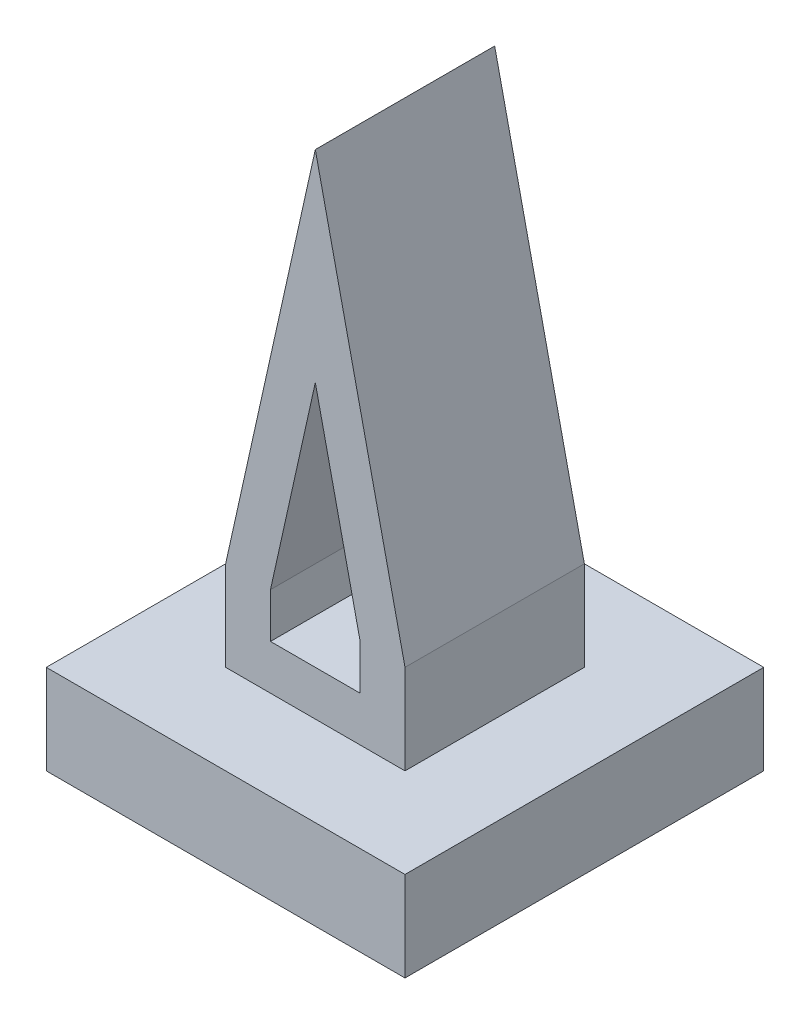
ISO-10303-21;
HEADER;
FILE_DESCRIPTION(('STEP AP214'),'2;1');
FILE_NAME('part.step','',(''),(''),'','','');
FILE_SCHEMA(('AUTOMOTIVE_DESIGN { 1 0 10303 214 1 1 1 1 }'));
ENDSEC;
DATA;
#1=APPLICATION_CONTEXT('core data for automotive mechanical design processes');
#2=APPLICATION_PROTOCOL_DEFINITION('international standard','automotive_design',2000,#1);
#3=PRODUCT_CONTEXT('',#1,'mechanical');
#4=PRODUCT('Part','Part','',(#3));
#5=PRODUCT_RELATED_PRODUCT_CATEGORY('part','',(#4));
#6=PRODUCT_DEFINITION_FORMATION('','',#4);
#7=PRODUCT_DEFINITION_CONTEXT('part definition',#1,'design');
#8=PRODUCT_DEFINITION('design','',#6,#7);
#9=PRODUCT_DEFINITION_SHAPE('','',#8);
#10=(LENGTH_UNIT() NAMED_UNIT(*) SI_UNIT(.MILLI.,.METRE.));
#11=(NAMED_UNIT(*) PLANE_ANGLE_UNIT() SI_UNIT($,.RADIAN.));
#12=(NAMED_UNIT(*) SI_UNIT($,.STERADIAN.) SOLID_ANGLE_UNIT());
#13=UNCERTAINTY_MEASURE_WITH_UNIT(LENGTH_MEASURE(1.E-05),#10,'distance_accuracy_value','');
#14=(GEOMETRIC_REPRESENTATION_CONTEXT(3) GLOBAL_UNCERTAINTY_ASSIGNED_CONTEXT((#13)) GLOBAL_UNIT_ASSIGNED_CONTEXT((#10,
#11,#12)) REPRESENTATION_CONTEXT('',''));
#15=CARTESIAN_POINT('',(0.,0.,0.));
#16=DIRECTION('',(0.,0.,1.));
#17=DIRECTION('',(1.,0.,0.));
#18=AXIS2_PLACEMENT_3D('',#15,#16,#17);
#19=CARTESIAN_POINT('',(-60.,130.,-20.));
#20=DIRECTION('',(0.,0.,-1.));
#21=DIRECTION('',(-1.,0.,0.));
#22=AXIS2_PLACEMENT_3D('',#19,#20,#21);
#23=PLANE('',#22);
#24=DIRECTION('',(-0.216930457818656,0.976187060183953,0.));
#25=VECTOR('',#24,1.);
#26=CARTESIAN_POINT('',(-9.04368029670929,-9.30343866480814,-20.));
#27=LINE('',#26,#25);
#28=CARTESIAN_POINT('',(-20.,40.,-20.));
#29=VERTEX_POINT('',#28);
#30=CARTESIAN_POINT('',(-40.,130.,-20.));
#31=VERTEX_POINT('',#30);
#32=EDGE_CURVE('E224',#29,#31,#27,.T.);
#33=ORIENTED_EDGE('',*,*,#32,.T.);
#34=DIRECTION('',(-0.216930457818656,-0.976187060183953,0.));
#35=VECTOR('',#34,1.);
#36=CARTESIAN_POINT('',(-70.9563197032907,-9.30343866480814,-20.));
#37=LINE('',#36,#35);
#38=CARTESIAN_POINT('',(-60.,40.,-20.));
#39=VERTEX_POINT('',#38);
#40=EDGE_CURVE('E236',#31,#39,#37,.T.);
#41=ORIENTED_EDGE('',*,*,#40,.T.);
#42=DIRECTION('',(0.,-1.,0.));
#43=VECTOR('',#42,1.);
#44=CARTESIAN_POINT('',(-60.,130.,-20.));
#45=LINE('',#44,#43);
#46=CARTESIAN_POINT('',(-60.,20.,-20.));
#47=VERTEX_POINT('',#46);
#48=EDGE_CURVE('E261',#39,#47,#45,.T.);
#49=ORIENTED_EDGE('',*,*,#48,.T.);
#50=DIRECTION('',(1.,0.,0.));
#51=VECTOR('',#50,1.);
#52=CARTESIAN_POINT('',(-60.,20.,-20.));
#53=LINE('',#52,#51);
#54=CARTESIAN_POINT('',(-20.,20.,-20.));
#55=VERTEX_POINT('',#54);
#56=EDGE_CURVE('E246',#47,#55,#53,.T.);
#57=ORIENTED_EDGE('',*,*,#56,.T.);
#58=DIRECTION('',(0.,-1.,0.));
#59=VECTOR('',#58,1.);
#60=CARTESIAN_POINT('',(-20.,130.,-20.));
#61=LINE('',#60,#59);
#62=EDGE_CURVE('E259',#29,#55,#61,.T.);
#63=ORIENTED_EDGE('',*,*,#62,.F.);
#64=EDGE_LOOP('',(#33,#41,#49,#57,#63));
#65=FACE_BOUND('',#64,.T.);
#66=DIRECTION('',(0.216930457818656,0.976187060183953,0.));
#67=VECTOR('',#66,1.);
#68=CARTESIAN_POINT('',(-61.4269079385848,-11.4210857236317,-20.));
#69=LINE('',#68,#67);
#70=CARTESIAN_POINT('',(-50.,40.,-20.));
#71=VERTEX_POINT('',#70);
#72=CARTESIAN_POINT('',(-40.,85.,-20.));
#73=VERTEX_POINT('',#72);
#74=EDGE_CURVE('E112',#71,#73,#69,.T.);
#75=ORIENTED_EDGE('',*,*,#74,.T.);
#76=DIRECTION('',(0.216930457818656,-0.976187060183953,0.));
#77=VECTOR('',#76,1.);
#78=CARTESIAN_POINT('',(-18.5730920614152,-11.4210857236317,-20.));
#79=LINE('',#78,#77);
#80=CARTESIAN_POINT('',(-30.,40.,-20.));
#81=VERTEX_POINT('',#80);
#82=EDGE_CURVE('E217',#73,#81,#79,.T.);
#83=ORIENTED_EDGE('',*,*,#82,.T.);
#84=DIRECTION('',(0.,-1.,0.));
#85=VECTOR('',#84,1.);
#86=CARTESIAN_POINT('',(-30.,-16.182620821095,-20.));
#87=LINE('',#86,#85);
#88=CARTESIAN_POINT('',(-30.,30.,-20.));
#89=VERTEX_POINT('',#88);
#90=EDGE_CURVE('E215',#81,#89,#87,.T.);
#91=ORIENTED_EDGE('',*,*,#90,.T.);
#92=DIRECTION('',(-1.,0.,0.));
#93=VECTOR('',#92,1.);
#94=CARTESIAN_POINT('',(-40.,30.,-20.));
#95=LINE('',#94,#93);
#96=CARTESIAN_POINT('',(-50.,30.,-20.));
#97=VERTEX_POINT('',#96);
#98=EDGE_CURVE('E200',#89,#97,#95,.T.);
#99=ORIENTED_EDGE('',*,*,#98,.T.);
#100=DIRECTION('',(0.,1.,0.));
#101=VECTOR('',#100,1.);
#102=CARTESIAN_POINT('',(-50.,-16.182620821095,-20.));
#103=LINE('',#102,#101);
#104=EDGE_CURVE('E209',#97,#71,#103,.T.);
#105=ORIENTED_EDGE('',*,*,#104,.T.);
#106=EDGE_LOOP('',(#75,#83,#91,#99,#105));
#107=FACE_BOUND('',#106,.T.);
#108=ADVANCED_FACE('F97',(#65,#107),#23,.F.);
#109=CARTESIAN_POINT('',(-60.,130.,-60.));
#110=DIRECTION('',(0.,0.,1.));
#111=DIRECTION('',(1.,0.,0.));
#112=AXIS2_PLACEMENT_3D('',#109,#110,#111);
#113=PLANE('',#112);
#114=DIRECTION('',(-0.216930457818656,0.976187060183953,0.));
#115=VECTOR('',#114,1.);
#116=CARTESIAN_POINT('',(-40.9411764705882,134.235294117647,-60.));
#117=LINE('',#116,#115);
#118=CARTESIAN_POINT('',(-20.,40.,-60.));
#119=VERTEX_POINT('',#118);
#120=CARTESIAN_POINT('',(-40.,130.,-60.));
#121=VERTEX_POINT('',#120);
#122=EDGE_CURVE('E232',#119,#121,#117,.T.);
#123=ORIENTED_EDGE('',*,*,#122,.F.);
#124=DIRECTION('',(0.,-1.,0.));
#125=VECTOR('',#124,1.);
#126=CARTESIAN_POINT('',(-20.,130.,-60.));
#127=LINE('',#126,#125);
#128=CARTESIAN_POINT('',(-20.,20.,-60.));
#129=VERTEX_POINT('',#128);
#130=EDGE_CURVE('E257',#119,#129,#127,.T.);
#131=ORIENTED_EDGE('',*,*,#130,.T.);
#132=DIRECTION('',(-1.,0.,0.));
#133=VECTOR('',#132,1.);
#134=CARTESIAN_POINT('',(-60.,20.,-60.));
#135=LINE('',#134,#133);
#136=CARTESIAN_POINT('',(-60.,20.,-60.));
#137=VERTEX_POINT('',#136);
#138=EDGE_CURVE('E252',#129,#137,#135,.T.);
#139=ORIENTED_EDGE('',*,*,#138,.T.);
#140=DIRECTION('',(0.,-1.,0.));
#141=VECTOR('',#140,1.);
#142=CARTESIAN_POINT('',(-60.,130.,-60.));
#143=LINE('',#142,#141);
#144=CARTESIAN_POINT('',(-60.,40.,-60.));
#145=VERTEX_POINT('',#144);
#146=EDGE_CURVE('E255',#145,#137,#143,.T.);
#147=ORIENTED_EDGE('',*,*,#146,.F.);
#148=DIRECTION('',(-0.216930457818656,-0.976187060183953,0.));
#149=VECTOR('',#148,1.);
#150=CARTESIAN_POINT('',(-40.9411764705882,125.764705882353,-60.));
#151=LINE('',#150,#149);
#152=EDGE_CURVE('E241',#121,#145,#151,.T.);
#153=ORIENTED_EDGE('',*,*,#152,.F.);
#154=EDGE_LOOP('',(#123,#131,#139,#147,#153));
#155=FACE_BOUND('',#154,.T.);
#156=DIRECTION('',(0.216930457818656,0.976187060183953,0.));
#157=VECTOR('',#156,1.);
#158=CARTESIAN_POINT('',(-31.4117647058824,123.647058823529,-60.));
#159=LINE('',#158,#157);
#160=CARTESIAN_POINT('',(-50.,40.,-60.));
#161=VERTEX_POINT('',#160);
#162=CARTESIAN_POINT('',(-40.,85.,-60.));
#163=VERTEX_POINT('',#162);
#164=EDGE_CURVE('E12',#161,#163,#159,.T.);
#165=ORIENTED_EDGE('',*,*,#164,.F.);
#166=DIRECTION('',(0.,1.,0.));
#167=VECTOR('',#166,1.);
#168=CARTESIAN_POINT('',(-50.,130.,-60.));
#169=LINE('',#168,#167);
#170=CARTESIAN_POINT('',(-50.,30.,-60.));
#171=VERTEX_POINT('',#170);
#172=EDGE_CURVE('E295',#171,#161,#169,.T.);
#173=ORIENTED_EDGE('',*,*,#172,.F.);
#174=DIRECTION('',(-1.,0.,0.));
#175=VECTOR('',#174,1.);
#176=CARTESIAN_POINT('',(-60.,30.,-60.));
#177=LINE('',#176,#175);
#178=CARTESIAN_POINT('',(-30.,30.,-60.));
#179=VERTEX_POINT('',#178);
#180=EDGE_CURVE('E203',#179,#171,#177,.T.);
#181=ORIENTED_EDGE('',*,*,#180,.F.);
#182=DIRECTION('',(0.,-1.,0.));
#183=VECTOR('',#182,1.);
#184=CARTESIAN_POINT('',(-30.,130.,-60.));
#185=LINE('',#184,#183);
#186=CARTESIAN_POINT('',(-30.,40.,-60.));
#187=VERTEX_POINT('',#186);
#188=EDGE_CURVE('E298',#187,#179,#185,.T.);
#189=ORIENTED_EDGE('',*,*,#188,.F.);
#190=DIRECTION('',(0.216930457818656,-0.976187060183953,0.));
#191=VECTOR('',#190,1.);
#192=CARTESIAN_POINT('',(-50.4705882352941,132.117647058824,-60.));
#193=LINE('',#192,#191);
#194=EDGE_CURVE('E105',#163,#187,#193,.T.);
#195=ORIENTED_EDGE('',*,*,#194,.F.);
#196=EDGE_LOOP('',(#165,#173,#181,#189,#195));
#197=FACE_BOUND('',#196,.T.);
#198=ADVANCED_FACE('F310',(#155,#197),#113,.F.);
#199=CARTESIAN_POINT('',(-20.,130.,-60.));
#200=DIRECTION('',(-1.,0.,0.));
#201=DIRECTION('',(0.,0.,1.));
#202=AXIS2_PLACEMENT_3D('',#199,#200,#201);
#203=PLANE('',#202);
#204=DIRECTION('',(0.,0.,1.));
#205=VECTOR('',#204,1.);
#206=CARTESIAN_POINT('',(-20.,40.,-130.));
#207=LINE('',#206,#205);
#208=EDGE_CURVE('E229',#119,#29,#207,.T.);
#209=ORIENTED_EDGE('',*,*,#208,.T.);
#210=ORIENTED_EDGE('',*,*,#62,.T.);
#211=DIRECTION('',(0.,0.,-1.));
#212=VECTOR('',#211,1.);
#213=CARTESIAN_POINT('',(-20.,20.,-60.));
#214=LINE('',#213,#212);
#215=EDGE_CURVE('E249',#55,#129,#214,.T.);
#216=ORIENTED_EDGE('',*,*,#215,.T.);
#217=ORIENTED_EDGE('',*,*,#130,.F.);
#218=EDGE_LOOP('',(#209,#210,#216,#217));
#219=FACE_BOUND('',#218,.T.);
#220=ADVANCED_FACE('F330',(#219),#203,.F.);
#221=CARTESIAN_POINT('',(-60.,130.,-60.));
#222=DIRECTION('',(1.,0.,0.));
#223=DIRECTION('',(0.,0.,-1.));
#224=AXIS2_PLACEMENT_3D('',#221,#222,#223);
#225=PLANE('',#224);
#226=DIRECTION('',(0.,0.,1.));
#227=VECTOR('',#226,1.);
#228=CARTESIAN_POINT('',(-60.,40.,-130.));
#229=LINE('',#228,#227);
#230=EDGE_CURVE('E239',#145,#39,#229,.T.);
#231=ORIENTED_EDGE('',*,*,#230,.F.);
#232=ORIENTED_EDGE('',*,*,#146,.T.);
#233=DIRECTION('',(0.,0.,1.));
#234=VECTOR('',#233,1.);
#235=CARTESIAN_POINT('',(-60.,20.,-60.));
#236=LINE('',#235,#234);
#237=EDGE_CURVE('E243',#137,#47,#236,.T.);
#238=ORIENTED_EDGE('',*,*,#237,.T.);
#239=ORIENTED_EDGE('',*,*,#48,.F.);
#240=EDGE_LOOP('',(#231,#232,#238,#239));
#241=FACE_BOUND('',#240,.T.);
#242=ADVANCED_FACE('F335',(#241),#225,.F.);
#243=CARTESIAN_POINT('',(0.,20.,-80.));
#244=DIRECTION('',(0.,1.,0.));
#245=DIRECTION('',(0.,0.,1.));
#246=AXIS2_PLACEMENT_3D('',#243,#244,#245);
#247=PLANE('',#246);
#248=DIRECTION('',(0.,0.,-1.));
#249=VECTOR('',#248,1.);
#250=CARTESIAN_POINT('',(0.,20.,0.));
#251=LINE('',#250,#249);
#252=CARTESIAN_POINT('',(0.,20.,0.));
#253=VERTEX_POINT('',#252);
#254=CARTESIAN_POINT('',(0.,20.,-80.));
#255=VERTEX_POINT('',#254);
#256=EDGE_CURVE('E264',#253,#255,#251,.T.);
#257=ORIENTED_EDGE('',*,*,#256,.T.);
#258=DIRECTION('',(-1.,0.,0.));
#259=VECTOR('',#258,1.);
#260=CARTESIAN_POINT('',(0.,20.,-80.));
#261=LINE('',#260,#259);
#262=CARTESIAN_POINT('',(-80.,20.,-80.));
#263=VERTEX_POINT('',#262);
#264=EDGE_CURVE('E267',#255,#263,#261,.T.);
#265=ORIENTED_EDGE('',*,*,#264,.T.);
#266=DIRECTION('',(0.,0.,1.));
#267=VECTOR('',#266,1.);
#268=CARTESIAN_POINT('',(-80.,20.,0.));
#269=LINE('',#268,#267);
#270=CARTESIAN_POINT('',(-80.,20.,0.));
#271=VERTEX_POINT('',#270);
#272=EDGE_CURVE('E270',#263,#271,#269,.T.);
#273=ORIENTED_EDGE('',*,*,#272,.T.);
#274=DIRECTION('',(1.,0.,0.));
#275=VECTOR('',#274,1.);
#276=CARTESIAN_POINT('',(0.,20.,0.));
#277=LINE('',#276,#275);
#278=EDGE_CURVE('E272',#271,#253,#277,.T.);
#279=ORIENTED_EDGE('',*,*,#278,.T.);
#280=EDGE_LOOP('',(#257,#265,#273,#279));
#281=FACE_BOUND('',#280,.T.);
#282=ORIENTED_EDGE('',*,*,#56,.F.);
#283=ORIENTED_EDGE('',*,*,#237,.F.);
#284=ORIENTED_EDGE('',*,*,#138,.F.);
#285=ORIENTED_EDGE('',*,*,#215,.F.);
#286=EDGE_LOOP('',(#282,#283,#284,#285));
#287=FACE_BOUND('',#286,.T.);
#288=ADVANCED_FACE('F338',(#281,#287),#247,.T.);
#289=CARTESIAN_POINT('',(0.,20.,0.));
#290=DIRECTION('',(-1.,0.,0.));
#291=DIRECTION('',(0.,0.,1.));
#292=AXIS2_PLACEMENT_3D('',#289,#290,#291);
#293=PLANE('',#292);
#294=DIRECTION('',(0.,0.,-1.));
#295=VECTOR('',#294,1.);
#296=CARTESIAN_POINT('',(0.,0.,0.));
#297=LINE('',#296,#295);
#298=CARTESIAN_POINT('',(0.,0.,0.));
#299=VERTEX_POINT('',#298);
#300=CARTESIAN_POINT('',(0.,0.,-80.));
#301=VERTEX_POINT('',#300);
#302=EDGE_CURVE('E263',#299,#301,#297,.T.);
#303=ORIENTED_EDGE('',*,*,#302,.T.);
#304=DIRECTION('',(0.,-1.,0.));
#305=VECTOR('',#304,1.);
#306=CARTESIAN_POINT('',(0.,20.,-80.));
#307=LINE('',#306,#305);
#308=EDGE_CURVE('E290',#255,#301,#307,.T.);
#309=ORIENTED_EDGE('',*,*,#308,.F.);
#310=ORIENTED_EDGE('',*,*,#256,.F.);
#311=DIRECTION('',(0.,-1.,0.));
#312=VECTOR('',#311,1.);
#313=CARTESIAN_POINT('',(0.,20.,0.));
#314=LINE('',#313,#312);
#315=EDGE_CURVE('E274',#253,#299,#314,.T.);
#316=ORIENTED_EDGE('',*,*,#315,.T.);
#317=EDGE_LOOP('',(#303,#309,#310,#316));
#318=FACE_BOUND('',#317,.T.);
#319=ADVANCED_FACE('F99',(#318),#293,.F.);
#320=CARTESIAN_POINT('',(0.,20.,-80.));
#321=DIRECTION('',(0.,0.,1.));
#322=DIRECTION('',(1.,0.,0.));
#323=AXIS2_PLACEMENT_3D('',#320,#321,#322);
#324=PLANE('',#323);
#325=DIRECTION('',(-1.,0.,0.));
#326=VECTOR('',#325,1.);
#327=CARTESIAN_POINT('',(0.,0.,-80.));
#328=LINE('',#327,#326);
#329=CARTESIAN_POINT('',(-80.,0.,-80.));
#330=VERTEX_POINT('',#329);
#331=EDGE_CURVE('E277',#301,#330,#328,.T.);
#332=ORIENTED_EDGE('',*,*,#331,.T.);
#333=DIRECTION('',(0.,-1.,0.));
#334=VECTOR('',#333,1.);
#335=CARTESIAN_POINT('',(-80.,20.,-80.));
#336=LINE('',#335,#334);
#337=EDGE_CURVE('E287',#263,#330,#336,.T.);
#338=ORIENTED_EDGE('',*,*,#337,.F.);
#339=ORIENTED_EDGE('',*,*,#264,.F.);
#340=ORIENTED_EDGE('',*,*,#308,.T.);
#341=EDGE_LOOP('',(#332,#338,#339,#340));
#342=FACE_BOUND('',#341,.T.);
#343=ADVANCED_FACE('F353',(#342),#324,.F.);
#344=CARTESIAN_POINT('',(-80.,20.,0.));
#345=DIRECTION('',(1.,0.,0.));
#346=DIRECTION('',(0.,0.,-1.));
#347=AXIS2_PLACEMENT_3D('',#344,#345,#346);
#348=PLANE('',#347);
#349=DIRECTION('',(0.,0.,1.));
#350=VECTOR('',#349,1.);
#351=CARTESIAN_POINT('',(-80.,0.,0.));
#352=LINE('',#351,#350);
#353=CARTESIAN_POINT('',(-80.,0.,0.));
#354=VERTEX_POINT('',#353);
#355=EDGE_CURVE('E279',#330,#354,#352,.T.);
#356=ORIENTED_EDGE('',*,*,#355,.T.);
#357=DIRECTION('',(0.,-1.,0.));
#358=VECTOR('',#357,1.);
#359=CARTESIAN_POINT('',(-80.,20.,0.));
#360=LINE('',#359,#358);
#361=EDGE_CURVE('E284',#271,#354,#360,.T.);
#362=ORIENTED_EDGE('',*,*,#361,.F.);
#363=ORIENTED_EDGE('',*,*,#272,.F.);
#364=ORIENTED_EDGE('',*,*,#337,.T.);
#365=EDGE_LOOP('',(#356,#362,#363,#364));
#366=FACE_BOUND('',#365,.T.);
#367=ADVANCED_FACE('F350',(#366),#348,.F.);
#368=CARTESIAN_POINT('',(0.,20.,0.));
#369=DIRECTION('',(0.,0.,-1.));
#370=DIRECTION('',(-1.,0.,0.));
#371=AXIS2_PLACEMENT_3D('',#368,#369,#370);
#372=PLANE('',#371);
#373=DIRECTION('',(1.,0.,0.));
#374=VECTOR('',#373,1.);
#375=CARTESIAN_POINT('',(0.,0.,0.));
#376=LINE('',#375,#374);
#377=EDGE_CURVE('E268',#354,#299,#376,.T.);
#378=ORIENTED_EDGE('',*,*,#377,.T.);
#379=ORIENTED_EDGE('',*,*,#315,.F.);
#380=ORIENTED_EDGE('',*,*,#278,.F.);
#381=ORIENTED_EDGE('',*,*,#361,.T.);
#382=EDGE_LOOP('',(#378,#379,#380,#381));
#383=FACE_BOUND('',#382,.T.);
#384=ADVANCED_FACE('F346',(#383),#372,.F.);
#385=CARTESIAN_POINT('',(0.,0.,-80.));
#386=DIRECTION('',(0.,1.,0.));
#387=DIRECTION('',(0.,0.,1.));
#388=AXIS2_PLACEMENT_3D('',#385,#386,#387);
#389=PLANE('',#388);
#390=ORIENTED_EDGE('',*,*,#302,.F.);
#391=ORIENTED_EDGE('',*,*,#377,.F.);
#392=ORIENTED_EDGE('',*,*,#355,.F.);
#393=ORIENTED_EDGE('',*,*,#331,.F.);
#394=EDGE_LOOP('',(#390,#391,#392,#393));
#395=FACE_BOUND('',#394,.T.);
#396=ADVANCED_FACE('F343',(#395),#389,.F.);
#397=CARTESIAN_POINT('',(-70.9563197032907,-9.30343866480814,-130.));
#398=DIRECTION('',(-0.976187060183953,0.216930457818656,0.));
#399=DIRECTION('',(-0.216930457818656,-0.976187060183953,0.));
#400=AXIS2_PLACEMENT_3D('',#397,#398,#399);
#401=PLANE('',#400);
#402=ORIENTED_EDGE('',*,*,#152,.T.);
#403=ORIENTED_EDGE('',*,*,#230,.T.);
#404=ORIENTED_EDGE('',*,*,#40,.F.);
#405=DIRECTION('',(0.,0.,1.));
#406=VECTOR('',#405,1.);
#407=CARTESIAN_POINT('',(-40.,130.,-20.));
#408=LINE('',#407,#406);
#409=EDGE_CURVE('E293',#121,#31,#408,.T.);
#410=ORIENTED_EDGE('',*,*,#409,.F.);
#411=EDGE_LOOP('',(#402,#403,#404,#410));
#412=FACE_BOUND('',#411,.T.);
#413=ADVANCED_FACE('F320',(#412),#401,.T.);
#414=CARTESIAN_POINT('',(-9.04368029670929,-9.30343866480814,-130.));
#415=DIRECTION('',(0.976187060183953,0.216930457818656,0.));
#416=DIRECTION('',(-0.216930457818656,0.976187060183953,0.));
#417=AXIS2_PLACEMENT_3D('',#414,#415,#416);
#418=PLANE('',#417);
#419=ORIENTED_EDGE('',*,*,#122,.T.);
#420=ORIENTED_EDGE('',*,*,#409,.T.);
#421=ORIENTED_EDGE('',*,*,#32,.F.);
#422=ORIENTED_EDGE('',*,*,#208,.F.);
#423=EDGE_LOOP('',(#419,#420,#421,#422));
#424=FACE_BOUND('',#423,.T.);
#425=ADVANCED_FACE('F313',(#424),#418,.T.);
#426=CARTESIAN_POINT('',(-61.4269079385848,-11.4210857236317,-130.));
#427=DIRECTION('',(0.976187060183953,-0.216930457818656,0.));
#428=DIRECTION('',(0.216930457818656,0.976187060183953,0.));
#429=AXIS2_PLACEMENT_3D('',#426,#427,#428);
#430=PLANE('',#429);
#431=ORIENTED_EDGE('',*,*,#164,.T.);
#432=DIRECTION('',(0.,0.,1.));
#433=VECTOR('',#432,1.);
#434=CARTESIAN_POINT('',(-40.,85.,-130.));
#435=LINE('',#434,#433);
#436=EDGE_CURVE('E222',#163,#73,#435,.T.);
#437=ORIENTED_EDGE('',*,*,#436,.T.);
#438=ORIENTED_EDGE('',*,*,#74,.F.);
#439=DIRECTION('',(0.,0.,1.));
#440=VECTOR('',#439,1.);
#441=CARTESIAN_POINT('',(-50.,40.,-130.));
#442=LINE('',#441,#440);
#443=EDGE_CURVE('E206',#161,#71,#442,.T.);
#444=ORIENTED_EDGE('',*,*,#443,.F.);
#445=EDGE_LOOP('',(#431,#437,#438,#444));
#446=FACE_BOUND('',#445,.T.);
#447=ADVANCED_FACE('F311',(#446),#430,.T.);
#448=CARTESIAN_POINT('',(-18.5730920614152,-11.4210857236317,-130.));
#449=DIRECTION('',(-0.976187060183953,-0.216930457818656,0.));
#450=DIRECTION('',(0.216930457818656,-0.976187060183953,0.));
#451=AXIS2_PLACEMENT_3D('',#448,#449,#450);
#452=PLANE('',#451);
#453=ORIENTED_EDGE('',*,*,#194,.T.);
#454=DIRECTION('',(0.,0.,1.));
#455=VECTOR('',#454,1.);
#456=CARTESIAN_POINT('',(-30.,40.,-130.));
#457=LINE('',#456,#455);
#458=EDGE_CURVE('E225',#187,#81,#457,.T.);
#459=ORIENTED_EDGE('',*,*,#458,.T.);
#460=ORIENTED_EDGE('',*,*,#82,.F.);
#461=ORIENTED_EDGE('',*,*,#436,.F.);
#462=EDGE_LOOP('',(#453,#459,#460,#461));
#463=FACE_BOUND('',#462,.T.);
#464=ADVANCED_FACE('F303',(#463),#452,.T.);
#465=CARTESIAN_POINT('',(-30.,-16.182620821095,-130.));
#466=DIRECTION('',(-1.,0.,0.));
#467=DIRECTION('',(0.,0.,1.));
#468=AXIS2_PLACEMENT_3D('',#465,#466,#467);
#469=PLANE('',#468);
#470=ORIENTED_EDGE('',*,*,#188,.T.);
#471=DIRECTION('',(0.,0.,1.));
#472=VECTOR('',#471,1.);
#473=CARTESIAN_POINT('',(-30.,30.,-130.));
#474=LINE('',#473,#472);
#475=EDGE_CURVE('E205',#179,#89,#474,.T.);
#476=ORIENTED_EDGE('',*,*,#475,.T.);
#477=ORIENTED_EDGE('',*,*,#90,.F.);
#478=ORIENTED_EDGE('',*,*,#458,.F.);
#479=EDGE_LOOP('',(#470,#476,#477,#478));
#480=FACE_BOUND('',#479,.T.);
#481=ADVANCED_FACE('F309',(#480),#469,.T.);
#482=CARTESIAN_POINT('',(-40.,30.,-130.));
#483=DIRECTION('',(0.,1.,0.));
#484=DIRECTION('',(-1.,0.,0.));
#485=AXIS2_PLACEMENT_3D('',#482,#483,#484);
#486=PLANE('',#485);
#487=ORIENTED_EDGE('',*,*,#180,.T.);
#488=DIRECTION('',(0.,0.,1.));
#489=VECTOR('',#488,1.);
#490=CARTESIAN_POINT('',(-50.,30.,-130.));
#491=LINE('',#490,#489);
#492=EDGE_CURVE('E120',#171,#97,#491,.T.);
#493=ORIENTED_EDGE('',*,*,#492,.T.);
#494=ORIENTED_EDGE('',*,*,#98,.F.);
#495=ORIENTED_EDGE('',*,*,#475,.F.);
#496=EDGE_LOOP('',(#487,#493,#494,#495));
#497=FACE_BOUND('',#496,.T.);
#498=ADVANCED_FACE('F197',(#497),#486,.T.);
#499=CARTESIAN_POINT('',(-50.,-16.182620821095,-130.));
#500=DIRECTION('',(1.,0.,0.));
#501=DIRECTION('',(0.,0.,-1.));
#502=AXIS2_PLACEMENT_3D('',#499,#500,#501);
#503=PLANE('',#502);
#504=ORIENTED_EDGE('',*,*,#172,.T.);
#505=ORIENTED_EDGE('',*,*,#443,.T.);
#506=ORIENTED_EDGE('',*,*,#104,.F.);
#507=ORIENTED_EDGE('',*,*,#492,.F.);
#508=EDGE_LOOP('',(#504,#505,#506,#507));
#509=FACE_BOUND('',#508,.T.);
#510=ADVANCED_FACE('F210',(#509),#503,.T.);
#511=CLOSED_SHELL('',(#108,#198,#220,#242,#288,#319,#343,#367,#384,#396,#413,#425,#447,#464,
#481,#498,#510));
#512=MANIFOLD_SOLID_BREP('B2',#511);
#513=ADVANCED_BREP_SHAPE_REPRESENTATION('',(#18,#512),#14);
#514=SHAPE_DEFINITION_REPRESENTATION(#9,#513);
ENDSEC;
END-ISO-10303-21;
